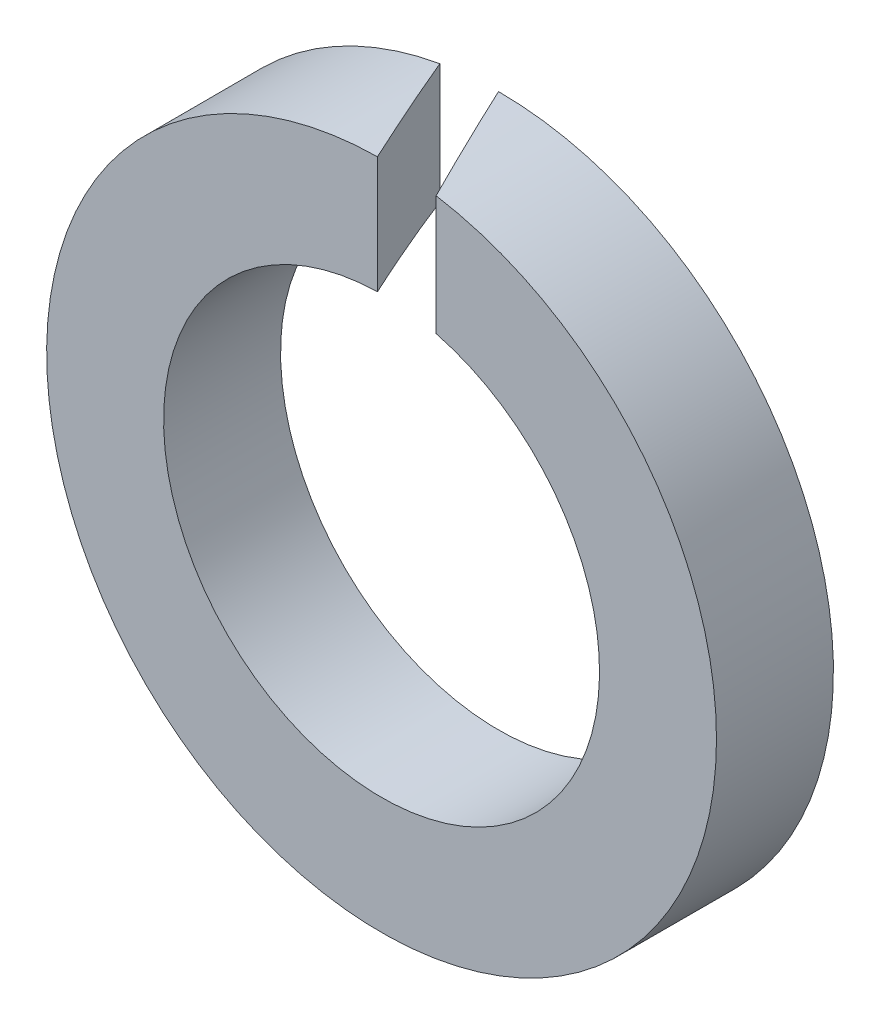
ISO-10303-21;
HEADER;
FILE_DESCRIPTION(('STEP AP214'),'2;1');
FILE_NAME('part.step','',(''),(''),'','','');
FILE_SCHEMA(('AUTOMOTIVE_DESIGN { 1 0 10303 214 1 1 1 1 }'));
ENDSEC;
DATA;
#1=APPLICATION_CONTEXT('core data for automotive mechanical design processes');
#2=APPLICATION_PROTOCOL_DEFINITION('international standard','automotive_design',2000,#1);
#3=PRODUCT_CONTEXT('',#1,'mechanical');
#4=PRODUCT('Part','Part','',(#3));
#5=PRODUCT_RELATED_PRODUCT_CATEGORY('part','',(#4));
#6=PRODUCT_DEFINITION_FORMATION('','',#4);
#7=PRODUCT_DEFINITION_CONTEXT('part definition',#1,'design');
#8=PRODUCT_DEFINITION('design','',#6,#7);
#9=PRODUCT_DEFINITION_SHAPE('','',#8);
#10=(LENGTH_UNIT() NAMED_UNIT(*) SI_UNIT(.MILLI.,.METRE.));
#11=(NAMED_UNIT(*) PLANE_ANGLE_UNIT() SI_UNIT($,.RADIAN.));
#12=(NAMED_UNIT(*) SI_UNIT($,.STERADIAN.) SOLID_ANGLE_UNIT());
#13=UNCERTAINTY_MEASURE_WITH_UNIT(LENGTH_MEASURE(1.E-05),#10,'distance_accuracy_value','');
#14=(GEOMETRIC_REPRESENTATION_CONTEXT(3) GLOBAL_UNCERTAINTY_ASSIGNED_CONTEXT((#13)) GLOBAL_UNIT_ASSIGNED_CONTEXT((#10,
#11,#12)) REPRESENTATION_CONTEXT('',''));
#15=CARTESIAN_POINT('',(0.,0.,0.));
#16=DIRECTION('',(0.,0.,1.));
#17=DIRECTION('',(1.,0.,0.));
#18=AXIS2_PLACEMENT_3D('',#15,#16,#17);
#19=CARTESIAN_POINT('',(0.,0.,1.09999999999999));
#20=DIRECTION('',(0.,0.,1.));
#21=DIRECTION('',(1.,0.,0.));
#22=AXIS2_PLACEMENT_3D('',#19,#20,#21);
#23=PLANE('',#22);
#24=CARTESIAN_POINT('',(0.,0.,1.09999999999999));
#25=DIRECTION('',(0.,0.,1.));
#26=DIRECTION('',(1.,0.,0.));
#27=AXIS2_PLACEMENT_3D('',#24,#25,#26);
#28=CIRCLE('',#27,2.05);
#29=CARTESIAN_POINT('',(-0.0387505355107232,2.04963372239944,1.10000000000007));
#30=VERTEX_POINT('',#29);
#31=CARTESIAN_POINT('',(0.512938423970599,1.98479071269822,1.10000000000007));
#32=VERTEX_POINT('',#31);
#33=EDGE_CURVE('E96',#30,#32,#28,.T.);
#34=ORIENTED_EDGE('',*,*,#33,.F.);
#35=DIRECTION('',(0.,-0.999999999999998,0.));
#36=VECTOR('',#35,1.);
#37=CARTESIAN_POINT('',(-0.0387505355106121,3.14999999999946,1.10000000000005));
#38=LINE('',#37,#36);
#39=CARTESIAN_POINT('',(-0.0387505355107232,3.14976164114,1.10000000000005));
#40=VERTEX_POINT('',#39);
#41=EDGE_CURVE('E59',#40,#30,#38,.T.);
#42=ORIENTED_EDGE('',*,*,#41,.F.);
#43=CARTESIAN_POINT('',(0.,0.,1.09999999999999));
#44=DIRECTION('',(0.,0.,1.));
#45=DIRECTION('',(1.,0.,0.));
#46=AXIS2_PLACEMENT_3D('',#43,#44,#45);
#47=CIRCLE('',#46,3.15);
#48=CARTESIAN_POINT('',(0.512938423970821,3.10795659126933,1.10000000000005));
#49=VERTEX_POINT('',#48);
#50=EDGE_CURVE('E95',#40,#49,#47,.T.);
#51=ORIENTED_EDGE('',*,*,#50,.T.);
#52=DIRECTION('',(0.,-0.999999999999998,0.));
#53=VECTOR('',#52,1.);
#54=CARTESIAN_POINT('',(0.512938423970488,3.15000000000012,1.10000000000005));
#55=LINE('',#54,#53);
#56=EDGE_CURVE('E77',#49,#32,#55,.T.);
#57=ORIENTED_EDGE('',*,*,#56,.T.);
#58=EDGE_LOOP('',(#34,#42,#51,#57));
#59=FACE_BOUND('',#58,.T.);
#60=ADVANCED_FACE('F36',(#59),#23,.T.);
#61=CARTESIAN_POINT('',(0.,0.,0.));
#62=DIRECTION('',(0.,0.,1.));
#63=DIRECTION('',(1.,0.,0.));
#64=AXIS2_PLACEMENT_3D('',#61,#62,#63);
#65=PLANE('',#64);
#66=DIRECTION('',(0.,-0.999999999999998,0.));
#67=VECTOR('',#66,1.);
#68=CARTESIAN_POINT('',(-0.551688959480989,3.14999999999954,0.));
#69=LINE('',#68,#67);
#70=CARTESIAN_POINT('',(-0.551688959481544,3.10131251117743,0.));
#71=VERTEX_POINT('',#70);
#72=CARTESIAN_POINT('',(-0.5516889594811,1.97437060654415,0.));
#73=VERTEX_POINT('',#72);
#74=EDGE_CURVE('E83',#71,#73,#69,.T.);
#75=ORIENTED_EDGE('',*,*,#74,.T.);
#76=CARTESIAN_POINT('',(0.,0.,0.));
#77=DIRECTION('',(0.,0.,1.));
#78=DIRECTION('',(1.,0.,0.));
#79=AXIS2_PLACEMENT_3D('',#76,#77,#78);
#80=CIRCLE('',#79,2.05);
#81=CARTESIAN_POINT('',(0.,2.0499999999998,0.));
#82=VERTEX_POINT('',#81);
#83=EDGE_CURVE('E92',#73,#82,#80,.T.);
#84=ORIENTED_EDGE('',*,*,#83,.T.);
#85=DIRECTION('',(0.,-0.999999999999998,0.));
#86=VECTOR('',#85,1.);
#87=CARTESIAN_POINT('',(3.33066907387547E-13,3.14999999999968,0.));
#88=LINE('',#87,#86);
#89=CARTESIAN_POINT('',(3.33066907387547E-13,3.14999999999968,0.));
#90=VERTEX_POINT('',#89);
#91=EDGE_CURVE('E51',#90,#82,#88,.T.);
#92=ORIENTED_EDGE('',*,*,#91,.F.);
#93=CARTESIAN_POINT('',(0.,0.,0.));
#94=DIRECTION('',(0.,0.,1.));
#95=DIRECTION('',(1.,0.,0.));
#96=AXIS2_PLACEMENT_3D('',#93,#94,#95);
#97=CIRCLE('',#96,3.15);
#98=EDGE_CURVE('E90',#71,#90,#97,.T.);
#99=ORIENTED_EDGE('',*,*,#98,.F.);
#100=EDGE_LOOP('',(#75,#84,#92,#99));
#101=FACE_BOUND('',#100,.T.);
#102=ADVANCED_FACE('F89',(#101),#65,.F.);
#103=CARTESIAN_POINT('',(0.,0.,1.09999999999999));
#104=DIRECTION('',(0.,0.,-1.));
#105=DIRECTION('',(-1.,0.,0.));
#106=AXIS2_PLACEMENT_3D('',#103,#104,#105);
#107=CYLINDRICAL_SURFACE('',#106,3.15);
#108=CARTESIAN_POINT('',(0.,0.,1.18310079157627));
#109=DIRECTION('',(0.906307787036652,0.,-0.422618261740696));
#110=DIRECTION('',(-0.422618261740699,0.,-0.906307787036651));
#111=AXIS2_PLACEMENT_3D('',#108,#109,#110);
#112=ELLIPSE('',#111,7.45353498693041,3.15);
#113=EDGE_CURVE('E82',#71,#40,#112,.T.);
#114=ORIENTED_EDGE('',*,*,#113,.F.);
#115=ORIENTED_EDGE('',*,*,#98,.T.);
#116=CARTESIAN_POINT('',(0.,0.,0.));
#117=DIRECTION('',(-0.906307787036652,0.,0.422618261740696));
#118=DIRECTION('',(-0.422618261740699,0.,-0.906307787036651));
#119=AXIS2_PLACEMENT_3D('',#116,#117,#118);
#120=ELLIPSE('',#119,7.45353498693041,3.15);
#121=EDGE_CURVE('E74',#49,#90,#120,.T.);
#122=ORIENTED_EDGE('',*,*,#121,.F.);
#123=ORIENTED_EDGE('',*,*,#50,.F.);
#124=EDGE_LOOP('',(#114,#115,#122,#123));
#125=FACE_BOUND('',#124,.T.);
#126=ADVANCED_FACE('F38',(#125),#107,.T.);
#127=CARTESIAN_POINT('',(0.,0.,1.09999999999999));
#128=DIRECTION('',(0.,0.,-1.));
#129=DIRECTION('',(-1.,0.,0.));
#130=AXIS2_PLACEMENT_3D('',#127,#128,#129);
#131=CYLINDRICAL_SURFACE('',#130,2.05);
#132=ORIENTED_EDGE('',*,*,#83,.F.);
#133=CARTESIAN_POINT('',(0.,0.,1.18310079157627));
#134=DIRECTION('',(0.906307787036652,0.,-0.422618261740696));
#135=DIRECTION('',(-0.422618261740699,0.,-0.906307787036651));
#136=AXIS2_PLACEMENT_3D('',#133,#134,#135);
#137=ELLIPSE('',#136,4.85071324546265,2.05);
#138=EDGE_CURVE('E11',#73,#30,#137,.T.);
#139=ORIENTED_EDGE('',*,*,#138,.T.);
#140=ORIENTED_EDGE('',*,*,#33,.T.);
#141=CARTESIAN_POINT('',(0.,0.,0.));
#142=DIRECTION('',(-0.906307787036652,0.,0.422618261740696));
#143=DIRECTION('',(-0.422618261740699,0.,-0.906307787036651));
#144=AXIS2_PLACEMENT_3D('',#141,#142,#143);
#145=ELLIPSE('',#144,4.85071324546265,2.05);
#146=EDGE_CURVE('E44',#32,#82,#145,.T.);
#147=ORIENTED_EDGE('',*,*,#146,.T.);
#148=EDGE_LOOP('',(#132,#139,#140,#147));
#149=FACE_BOUND('',#148,.T.);
#150=ADVANCED_FACE('F103',(#149),#131,.F.);
#151=CARTESIAN_POINT('',(3.33066907387547E-13,3.14999999999968,0.));
#152=DIRECTION('',(-0.906307787036652,0.,0.422618261740696));
#153=DIRECTION('',(0.422618261740699,0.,0.906307787036651));
#154=AXIS2_PLACEMENT_3D('',#151,#152,#153);
#155=PLANE('',#154);
#156=ORIENTED_EDGE('',*,*,#121,.T.);
#157=ORIENTED_EDGE('',*,*,#91,.T.);
#158=ORIENTED_EDGE('',*,*,#146,.F.);
#159=ORIENTED_EDGE('',*,*,#56,.F.);
#160=EDGE_LOOP('',(#156,#157,#158,#159));
#161=FACE_BOUND('',#160,.T.);
#162=ADVANCED_FACE('F75',(#161),#155,.T.);
#163=CARTESIAN_POINT('',(-0.551688959480989,3.14999999999954,0.));
#164=DIRECTION('',(0.906307787036652,0.,-0.422618261740696));
#165=DIRECTION('',(-0.422618261740699,0.,-0.906307787036651));
#166=AXIS2_PLACEMENT_3D('',#163,#164,#165);
#167=PLANE('',#166);
#168=ORIENTED_EDGE('',*,*,#113,.T.);
#169=ORIENTED_EDGE('',*,*,#41,.T.);
#170=ORIENTED_EDGE('',*,*,#138,.F.);
#171=ORIENTED_EDGE('',*,*,#74,.F.);
#172=EDGE_LOOP('',(#168,#169,#170,#171));
#173=FACE_BOUND('',#172,.T.);
#174=ADVANCED_FACE('F110',(#173),#167,.T.);
#175=CLOSED_SHELL('',(#60,#102,#126,#150,#162,#174));
#176=MANIFOLD_SOLID_BREP('B2',#175);
#177=ADVANCED_BREP_SHAPE_REPRESENTATION('',(#18,#176),#14);
#178=SHAPE_DEFINITION_REPRESENTATION(#9,#177);
ENDSEC;
END-ISO-10303-21;
